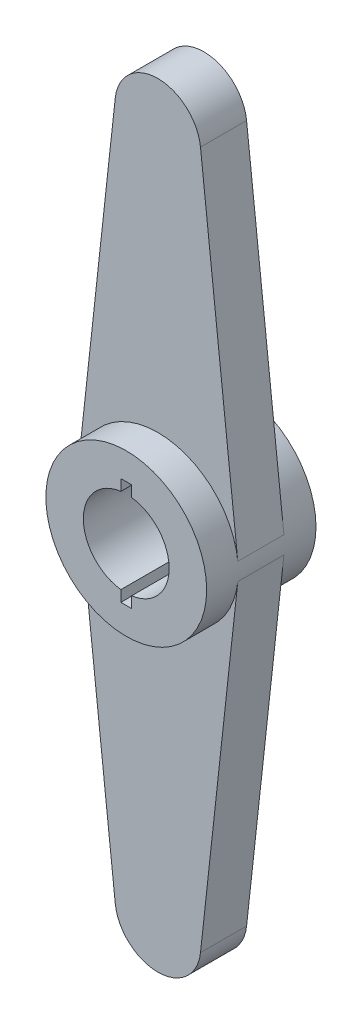
ISO-10303-21;
HEADER;
FILE_DESCRIPTION(('STEP AP214'),'2;1');
FILE_NAME('part.step','',(''),(''),'','','');
FILE_SCHEMA(('AUTOMOTIVE_DESIGN { 1 0 10303 214 1 1 1 1 }'));
ENDSEC;
DATA;
#1=APPLICATION_CONTEXT('core data for automotive mechanical design processes');
#2=APPLICATION_PROTOCOL_DEFINITION('international standard','automotive_design',2000,#1);
#3=PRODUCT_CONTEXT('',#1,'mechanical');
#4=PRODUCT('Part','Part','',(#3));
#5=PRODUCT_RELATED_PRODUCT_CATEGORY('part','',(#4));
#6=PRODUCT_DEFINITION_FORMATION('','',#4);
#7=PRODUCT_DEFINITION_CONTEXT('part definition',#1,'design');
#8=PRODUCT_DEFINITION('design','',#6,#7);
#9=PRODUCT_DEFINITION_SHAPE('','',#8);
#10=(LENGTH_UNIT() NAMED_UNIT(*) SI_UNIT(.MILLI.,.METRE.));
#11=(NAMED_UNIT(*) PLANE_ANGLE_UNIT() SI_UNIT($,.RADIAN.));
#12=(NAMED_UNIT(*) SI_UNIT($,.STERADIAN.) SOLID_ANGLE_UNIT());
#13=UNCERTAINTY_MEASURE_WITH_UNIT(LENGTH_MEASURE(1.E-05),#10,'distance_accuracy_value','');
#14=(GEOMETRIC_REPRESENTATION_CONTEXT(3) GLOBAL_UNCERTAINTY_ASSIGNED_CONTEXT((#13)) GLOBAL_UNIT_ASSIGNED_CONTEXT((#10,
#11,#12)) REPRESENTATION_CONTEXT('',''));
#15=CARTESIAN_POINT('',(0.,0.,0.));
#16=DIRECTION('',(0.,0.,1.));
#17=DIRECTION('',(1.,0.,0.));
#18=AXIS2_PLACEMENT_3D('',#15,#16,#17);
#19=CARTESIAN_POINT('',(0.,0.,2.55));
#20=DIRECTION('',(0.,0.,-1.));
#21=DIRECTION('',(-1.,0.,0.));
#22=AXIS2_PLACEMENT_3D('',#19,#20,#21);
#23=CYLINDRICAL_SURFACE('',#22,2.);
#24=CARTESIAN_POINT('',(0.,0.,-2.55));
#25=DIRECTION('',(0.,0.,1.));
#26=DIRECTION('',(1.,0.,0.));
#27=AXIS2_PLACEMENT_3D('',#24,#25,#26);
#28=CIRCLE('',#27,2.);
#29=CARTESIAN_POINT('',(-0.25,1.98431348329844,-2.55));
#30=VERTEX_POINT('',#29);
#31=CARTESIAN_POINT('',(-0.25,-1.98431348329844,-2.55));
#32=VERTEX_POINT('',#31);
#33=EDGE_CURVE('E216',#30,#32,#28,.T.);
#34=ORIENTED_EDGE('',*,*,#33,.F.);
#35=DIRECTION('',(0.,0.,-1.));
#36=VECTOR('',#35,1.);
#37=CARTESIAN_POINT('',(-0.25,1.98431348329844,2.55));
#38=LINE('',#37,#36);
#39=CARTESIAN_POINT('',(-0.25,1.98431348329844,2.55));
#40=VERTEX_POINT('',#39);
#41=EDGE_CURVE('E11',#40,#30,#38,.T.);
#42=ORIENTED_EDGE('',*,*,#41,.F.);
#43=CARTESIAN_POINT('',(0.,0.,2.55));
#44=DIRECTION('',(0.,0.,1.));
#45=DIRECTION('',(1.,0.,0.));
#46=AXIS2_PLACEMENT_3D('',#43,#44,#45);
#47=CIRCLE('',#46,2.);
#48=CARTESIAN_POINT('',(-0.25,-1.98431348329844,2.55));
#49=VERTEX_POINT('',#48);
#50=EDGE_CURVE('E217',#40,#49,#47,.T.);
#51=ORIENTED_EDGE('',*,*,#50,.T.);
#52=DIRECTION('',(0.,0.,-1.));
#53=VECTOR('',#52,1.);
#54=CARTESIAN_POINT('',(-0.25,-1.98431348329844,2.55));
#55=LINE('',#54,#53);
#56=EDGE_CURVE('E237',#49,#32,#55,.T.);
#57=ORIENTED_EDGE('',*,*,#56,.T.);
#58=EDGE_LOOP('',(#34,#42,#51,#57));
#59=FACE_BOUND('',#58,.T.);
#60=ADVANCED_FACE('F36',(#59),#23,.F.);
#61=CARTESIAN_POINT('',(-0.25,0.,2.55));
#62=DIRECTION('',(-1.,0.,0.));
#63=DIRECTION('',(0.,0.,1.));
#64=AXIS2_PLACEMENT_3D('',#61,#62,#63);
#65=PLANE('',#64);
#66=DIRECTION('',(0.,1.,0.));
#67=VECTOR('',#66,1.);
#68=CARTESIAN_POINT('',(-0.25,0.,-2.55));
#69=LINE('',#68,#67);
#70=CARTESIAN_POINT('',(-0.25,2.5,-2.55));
#71=VERTEX_POINT('',#70);
#72=EDGE_CURVE('E240',#30,#71,#69,.T.);
#73=ORIENTED_EDGE('',*,*,#72,.T.);
#74=DIRECTION('',(0.,0.,-1.));
#75=VECTOR('',#74,1.);
#76=CARTESIAN_POINT('',(-0.25,2.5,2.55));
#77=LINE('',#76,#75);
#78=CARTESIAN_POINT('',(-0.25,2.5,2.55));
#79=VERTEX_POINT('',#78);
#80=EDGE_CURVE('E44',#79,#71,#77,.T.);
#81=ORIENTED_EDGE('',*,*,#80,.F.);
#82=DIRECTION('',(0.,1.,0.));
#83=VECTOR('',#82,1.);
#84=CARTESIAN_POINT('',(-0.25,0.,2.55));
#85=LINE('',#84,#83);
#86=EDGE_CURVE('E220',#40,#79,#85,.T.);
#87=ORIENTED_EDGE('',*,*,#86,.F.);
#88=ORIENTED_EDGE('',*,*,#41,.T.);
#89=EDGE_LOOP('',(#73,#81,#87,#88));
#90=FACE_BOUND('',#89,.T.);
#91=ADVANCED_FACE('F274',(#90),#65,.F.);
#92=CARTESIAN_POINT('',(0.,2.5,2.55));
#93=DIRECTION('',(0.,-1.,0.));
#94=DIRECTION('',(0.,0.,-1.));
#95=AXIS2_PLACEMENT_3D('',#92,#93,#94);
#96=PLANE('',#95);
#97=DIRECTION('',(-1.,0.,0.));
#98=VECTOR('',#97,1.);
#99=CARTESIAN_POINT('',(0.,2.5,-2.55));
#100=LINE('',#99,#98);
#101=CARTESIAN_POINT('',(0.25,2.5,-2.55));
#102=VERTEX_POINT('',#101);
#103=EDGE_CURVE('E244',#102,#71,#100,.T.);
#104=ORIENTED_EDGE('',*,*,#103,.F.);
#105=DIRECTION('',(0.,0.,-1.));
#106=VECTOR('',#105,1.);
#107=CARTESIAN_POINT('',(0.25,2.5,2.55));
#108=LINE('',#107,#106);
#109=CARTESIAN_POINT('',(0.25,2.5,2.55));
#110=VERTEX_POINT('',#109);
#111=EDGE_CURVE('E266',#110,#102,#108,.T.);
#112=ORIENTED_EDGE('',*,*,#111,.F.);
#113=DIRECTION('',(-1.,0.,0.));
#114=VECTOR('',#113,1.);
#115=CARTESIAN_POINT('',(0.,2.5,2.55));
#116=LINE('',#115,#114);
#117=EDGE_CURVE('E224',#110,#79,#116,.T.);
#118=ORIENTED_EDGE('',*,*,#117,.T.);
#119=ORIENTED_EDGE('',*,*,#80,.T.);
#120=EDGE_LOOP('',(#104,#112,#118,#119));
#121=FACE_BOUND('',#120,.T.);
#122=ADVANCED_FACE('F38',(#121),#96,.T.);
#123=CARTESIAN_POINT('',(0.25,0.,2.55));
#124=DIRECTION('',(-1.,0.,0.));
#125=DIRECTION('',(0.,0.,1.));
#126=AXIS2_PLACEMENT_3D('',#123,#124,#125);
#127=PLANE('',#126);
#128=DIRECTION('',(0.,1.,0.));
#129=VECTOR('',#128,1.);
#130=CARTESIAN_POINT('',(0.25,0.,-2.55));
#131=LINE('',#130,#129);
#132=CARTESIAN_POINT('',(0.25,1.98431348329844,-2.55));
#133=VERTEX_POINT('',#132);
#134=EDGE_CURVE('E248',#133,#102,#131,.T.);
#135=ORIENTED_EDGE('',*,*,#134,.F.);
#136=DIRECTION('',(0.,0.,-1.));
#137=VECTOR('',#136,1.);
#138=CARTESIAN_POINT('',(0.25,1.98431348329844,2.55));
#139=LINE('',#138,#137);
#140=CARTESIAN_POINT('',(0.25,1.98431348329844,2.55));
#141=VERTEX_POINT('',#140);
#142=EDGE_CURVE('E264',#141,#133,#139,.T.);
#143=ORIENTED_EDGE('',*,*,#142,.F.);
#144=DIRECTION('',(0.,1.,0.));
#145=VECTOR('',#144,1.);
#146=CARTESIAN_POINT('',(0.25,0.,2.55));
#147=LINE('',#146,#145);
#148=EDGE_CURVE('E228',#141,#110,#147,.T.);
#149=ORIENTED_EDGE('',*,*,#148,.T.);
#150=ORIENTED_EDGE('',*,*,#111,.T.);
#151=EDGE_LOOP('',(#135,#143,#149,#150));
#152=FACE_BOUND('',#151,.T.);
#153=ADVANCED_FACE('F284',(#152),#127,.T.);
#154=CARTESIAN_POINT('',(0.25,-1.98431348329844,-2.55));
#155=VERTEX_POINT('',#154);
#156=EDGE_CURVE('E241',#155,#133,#28,.T.);
#157=ORIENTED_EDGE('',*,*,#156,.F.);
#158=DIRECTION('',(0.,0.,-1.));
#159=VECTOR('',#158,1.);
#160=CARTESIAN_POINT('',(0.25,-1.98431348329844,2.55));
#161=LINE('',#160,#159);
#162=CARTESIAN_POINT('',(0.25,-1.98431348329844,2.55));
#163=VERTEX_POINT('',#162);
#164=EDGE_CURVE('E262',#163,#155,#161,.T.);
#165=ORIENTED_EDGE('',*,*,#164,.F.);
#166=EDGE_CURVE('E222',#163,#141,#47,.T.);
#167=ORIENTED_EDGE('',*,*,#166,.T.);
#168=ORIENTED_EDGE('',*,*,#142,.T.);
#169=EDGE_LOOP('',(#157,#165,#167,#168));
#170=FACE_BOUND('',#169,.T.);
#171=ADVANCED_FACE('F310',(#170),#23,.F.);
#172=CARTESIAN_POINT('',(0.25,-2.5,-2.55));
#173=VERTEX_POINT('',#172);
#174=EDGE_CURVE('E251',#173,#155,#131,.T.);
#175=ORIENTED_EDGE('',*,*,#174,.F.);
#176=DIRECTION('',(0.,0.,-1.));
#177=VECTOR('',#176,1.);
#178=CARTESIAN_POINT('',(0.25,-2.5,2.55));
#179=LINE('',#178,#177);
#180=CARTESIAN_POINT('',(0.25,-2.5,2.55));
#181=VERTEX_POINT('',#180);
#182=EDGE_CURVE('E260',#181,#173,#179,.T.);
#183=ORIENTED_EDGE('',*,*,#182,.F.);
#184=EDGE_CURVE('E231',#181,#163,#147,.T.);
#185=ORIENTED_EDGE('',*,*,#184,.T.);
#186=ORIENTED_EDGE('',*,*,#164,.T.);
#187=EDGE_LOOP('',(#175,#183,#185,#186));
#188=FACE_BOUND('',#187,.T.);
#189=ADVANCED_FACE('F308',(#188),#127,.T.);
#190=CARTESIAN_POINT('',(0.,-2.5,2.55));
#191=DIRECTION('',(0.,-1.,0.));
#192=DIRECTION('',(0.,0.,-1.));
#193=AXIS2_PLACEMENT_3D('',#190,#191,#192);
#194=PLANE('',#193);
#195=DIRECTION('',(-1.,0.,0.));
#196=VECTOR('',#195,1.);
#197=CARTESIAN_POINT('',(0.,-2.5,-2.55));
#198=LINE('',#197,#196);
#199=CARTESIAN_POINT('',(-0.25,-2.5,-2.55));
#200=VERTEX_POINT('',#199);
#201=EDGE_CURVE('E252',#173,#200,#198,.T.);
#202=ORIENTED_EDGE('',*,*,#201,.T.);
#203=DIRECTION('',(0.,0.,-1.));
#204=VECTOR('',#203,1.);
#205=CARTESIAN_POINT('',(-0.25,-2.5,2.55));
#206=LINE('',#205,#204);
#207=CARTESIAN_POINT('',(-0.25,-2.5,2.55));
#208=VERTEX_POINT('',#207);
#209=EDGE_CURVE('E257',#208,#200,#206,.T.);
#210=ORIENTED_EDGE('',*,*,#209,.F.);
#211=DIRECTION('',(-1.,0.,0.));
#212=VECTOR('',#211,1.);
#213=CARTESIAN_POINT('',(0.,-2.5,2.55));
#214=LINE('',#213,#212);
#215=EDGE_CURVE('E232',#181,#208,#214,.T.);
#216=ORIENTED_EDGE('',*,*,#215,.F.);
#217=ORIENTED_EDGE('',*,*,#182,.T.);
#218=EDGE_LOOP('',(#202,#210,#216,#217));
#219=FACE_BOUND('',#218,.T.);
#220=ADVANCED_FACE('F304',(#219),#194,.F.);
#221=EDGE_CURVE('E245',#200,#32,#69,.T.);
#222=ORIENTED_EDGE('',*,*,#221,.T.);
#223=ORIENTED_EDGE('',*,*,#56,.F.);
#224=EDGE_CURVE('E225',#208,#49,#85,.T.);
#225=ORIENTED_EDGE('',*,*,#224,.F.);
#226=ORIENTED_EDGE('',*,*,#209,.T.);
#227=EDGE_LOOP('',(#222,#223,#225,#226));
#228=FACE_BOUND('',#227,.T.);
#229=ADVANCED_FACE('F300',(#228),#65,.F.);
#230=CARTESIAN_POINT('',(0.,0.,2.55));
#231=DIRECTION('',(0.,0.,-1.));
#232=DIRECTION('',(-1.,0.,0.));
#233=AXIS2_PLACEMENT_3D('',#230,#231,#232);
#234=CYLINDRICAL_SURFACE('',#233,3.75);
#235=DIRECTION('',(0.,0.,-1.));
#236=VECTOR('',#235,1.);
#237=CARTESIAN_POINT('',(-3.72764246788992,-0.408878504672898,1.075));
#238=LINE('',#237,#236);
#239=CARTESIAN_POINT('',(-3.72764246788992,-0.408878504672898,1.075));
#240=VERTEX_POINT('',#239);
#241=CARTESIAN_POINT('',(-3.72764246788992,-0.408878504672898,-1.075));
#242=VERTEX_POINT('',#241);
#243=EDGE_CURVE('E51',#240,#242,#238,.T.);
#244=ORIENTED_EDGE('',*,*,#243,.F.);
#245=CARTESIAN_POINT('',(0.,0.,1.075));
#246=DIRECTION('',(0.,0.,1.));
#247=DIRECTION('',(1.,0.,0.));
#248=AXIS2_PLACEMENT_3D('',#245,#246,#247);
#249=CIRCLE('',#248,3.75);
#250=CARTESIAN_POINT('',(3.72764246788992,-0.408878504672896,1.075));
#251=VERTEX_POINT('',#250);
#252=EDGE_CURVE('E56',#240,#251,#249,.T.);
#253=ORIENTED_EDGE('',*,*,#252,.T.);
#254=DIRECTION('',(0.,0.,-1.));
#255=VECTOR('',#254,1.);
#256=CARTESIAN_POINT('',(3.72764246788992,-0.408878504672896,1.075));
#257=LINE('',#256,#255);
#258=CARTESIAN_POINT('',(3.72764246788992,-0.408878504672896,-1.075));
#259=VERTEX_POINT('',#258);
#260=EDGE_CURVE('E168',#251,#259,#257,.T.);
#261=ORIENTED_EDGE('',*,*,#260,.T.);
#262=CARTESIAN_POINT('',(0.,0.,-1.075));
#263=DIRECTION('',(0.,0.,1.));
#264=DIRECTION('',(1.,0.,0.));
#265=AXIS2_PLACEMENT_3D('',#262,#263,#264);
#266=CIRCLE('',#265,3.75);
#267=EDGE_CURVE('E172',#242,#259,#266,.T.);
#268=ORIENTED_EDGE('',*,*,#267,.F.);
#269=EDGE_LOOP('',(#244,#253,#261,#268));
#270=FACE_BOUND('',#269,.T.);
#271=DIRECTION('',(0.,0.,-1.));
#272=VECTOR('',#271,1.);
#273=CARTESIAN_POINT('',(3.72764246788992,0.408878504672897,1.075));
#274=LINE('',#273,#272);
#275=CARTESIAN_POINT('',(3.72764246788992,0.408878504672897,1.075));
#276=VERTEX_POINT('',#275);
#277=CARTESIAN_POINT('',(3.72764246788992,0.408878504672897,-1.075));
#278=VERTEX_POINT('',#277);
#279=EDGE_CURVE('E196',#276,#278,#274,.T.);
#280=ORIENTED_EDGE('',*,*,#279,.F.);
#281=CARTESIAN_POINT('',(0.,0.,1.075));
#282=DIRECTION('',(0.,0.,1.));
#283=DIRECTION('',(1.,0.,0.));
#284=AXIS2_PLACEMENT_3D('',#281,#282,#283);
#285=CIRCLE('',#284,3.75);
#286=CARTESIAN_POINT('',(-3.72764246788992,0.408878504672897,1.075));
#287=VERTEX_POINT('',#286);
#288=EDGE_CURVE('E194',#276,#287,#285,.T.);
#289=ORIENTED_EDGE('',*,*,#288,.T.);
#290=DIRECTION('',(0.,0.,-1.));
#291=VECTOR('',#290,1.);
#292=CARTESIAN_POINT('',(-3.72764246788992,0.408878504672897,1.075));
#293=LINE('',#292,#291);
#294=CARTESIAN_POINT('',(-3.72764246788992,0.408878504672897,-1.075));
#295=VERTEX_POINT('',#294);
#296=EDGE_CURVE('E209',#287,#295,#293,.T.);
#297=ORIENTED_EDGE('',*,*,#296,.T.);
#298=CARTESIAN_POINT('',(0.,0.,-1.075));
#299=DIRECTION('',(0.,0.,1.));
#300=DIRECTION('',(1.,0.,0.));
#301=AXIS2_PLACEMENT_3D('',#298,#299,#300);
#302=CIRCLE('',#301,3.75);
#303=EDGE_CURVE('E189',#278,#295,#302,.T.);
#304=ORIENTED_EDGE('',*,*,#303,.F.);
#305=EDGE_LOOP('',(#280,#289,#297,#304));
#306=FACE_BOUND('',#305,.T.);
#307=CARTESIAN_POINT('',(0.,0.,2.55));
#308=DIRECTION('',(0.,0.,1.));
#309=DIRECTION('',(1.,0.,0.));
#310=AXIS2_PLACEMENT_3D('',#307,#308,#309);
#311=CIRCLE('',#310,3.75);
#312=CARTESIAN_POINT('',(3.75,0.,2.55));
#313=VERTEX_POINT('',#312);
#314=EDGE_CURVE('E234',#313,#313,#311,.T.);
#315=ORIENTED_EDGE('',*,*,#314,.F.);
#316=EDGE_LOOP('',(#315));
#317=FACE_BOUND('',#316,.T.);
#318=CARTESIAN_POINT('',(0.,0.,-2.55));
#319=DIRECTION('',(0.,0.,1.));
#320=DIRECTION('',(1.,0.,0.));
#321=AXIS2_PLACEMENT_3D('',#318,#319,#320);
#322=CIRCLE('',#321,3.75);
#323=CARTESIAN_POINT('',(3.75,0.,-2.55));
#324=VERTEX_POINT('',#323);
#325=EDGE_CURVE('E221',#324,#324,#322,.T.);
#326=ORIENTED_EDGE('',*,*,#325,.T.);
#327=EDGE_LOOP('',(#326));
#328=FACE_BOUND('',#327,.T.);
#329=ADVANCED_FACE('F328',(#270,#306,#317,#328),#234,.T.);
#330=CARTESIAN_POINT('',(0.,0.,2.55));
#331=DIRECTION('',(0.,0.,1.));
#332=DIRECTION('',(1.,0.,0.));
#333=AXIS2_PLACEMENT_3D('',#330,#331,#332);
#334=PLANE('',#333);
#335=ORIENTED_EDGE('',*,*,#50,.F.);
#336=ORIENTED_EDGE('',*,*,#86,.T.);
#337=ORIENTED_EDGE('',*,*,#117,.F.);
#338=ORIENTED_EDGE('',*,*,#148,.F.);
#339=ORIENTED_EDGE('',*,*,#166,.F.);
#340=ORIENTED_EDGE('',*,*,#184,.F.);
#341=ORIENTED_EDGE('',*,*,#215,.T.);
#342=ORIENTED_EDGE('',*,*,#224,.T.);
#343=EDGE_LOOP('',(#335,#336,#337,#338,#339,#340,#341,#342));
#344=FACE_BOUND('',#343,.T.);
#345=ORIENTED_EDGE('',*,*,#314,.T.);
#346=EDGE_LOOP('',(#345));
#347=FACE_BOUND('',#346,.T.);
#348=ADVANCED_FACE('F288',(#344,#347),#334,.T.);
#349=CARTESIAN_POINT('',(0.,0.,-2.55));
#350=DIRECTION('',(0.,0.,1.));
#351=DIRECTION('',(1.,0.,0.));
#352=AXIS2_PLACEMENT_3D('',#349,#350,#351);
#353=PLANE('',#352);
#354=ORIENTED_EDGE('',*,*,#33,.T.);
#355=ORIENTED_EDGE('',*,*,#221,.F.);
#356=ORIENTED_EDGE('',*,*,#201,.F.);
#357=ORIENTED_EDGE('',*,*,#174,.T.);
#358=ORIENTED_EDGE('',*,*,#156,.T.);
#359=ORIENTED_EDGE('',*,*,#134,.T.);
#360=ORIENTED_EDGE('',*,*,#103,.T.);
#361=ORIENTED_EDGE('',*,*,#72,.F.);
#362=EDGE_LOOP('',(#354,#355,#356,#357,#358,#359,#360,#361));
#363=FACE_BOUND('',#362,.T.);
#364=ORIENTED_EDGE('',*,*,#325,.F.);
#365=EDGE_LOOP('',(#364));
#366=FACE_BOUND('',#365,.T.);
#367=ADVANCED_FACE('F277',(#363,#366),#353,.F.);
#368=CARTESIAN_POINT('',(3.72764246788992,0.408878504672897,1.075));
#369=DIRECTION('',(-0.994037991437312,-0.109034267912773,0.));
#370=DIRECTION('',(0.109034267912773,-0.994037991437312,0.));
#371=AXIS2_PLACEMENT_3D('',#368,#369,#370);
#372=PLANE('',#371);
#373=DIRECTION('',(-0.109034267912773,0.994037991437312,0.));
#374=VECTOR('',#373,1.);
#375=CARTESIAN_POINT('',(3.72764246788992,0.408878504672897,-1.075));
#376=LINE('',#375,#374);
#377=CARTESIAN_POINT('',(1.98807598287462,16.2680685358255,-1.075));
#378=VERTEX_POINT('',#377);
#379=EDGE_CURVE('E184',#278,#378,#376,.T.);
#380=ORIENTED_EDGE('',*,*,#379,.T.);
#381=DIRECTION('',(0.,0.,-1.));
#382=VECTOR('',#381,1.);
#383=CARTESIAN_POINT('',(1.98807598287462,16.2680685358255,1.075));
#384=LINE('',#383,#382);
#385=CARTESIAN_POINT('',(1.98807598287462,16.2680685358255,1.075));
#386=VERTEX_POINT('',#385);
#387=EDGE_CURVE('E213',#386,#378,#384,.T.);
#388=ORIENTED_EDGE('',*,*,#387,.F.);
#389=DIRECTION('',(-0.109034267912773,0.994037991437312,0.));
#390=VECTOR('',#389,1.);
#391=CARTESIAN_POINT('',(3.72764246788992,0.408878504672897,1.075));
#392=LINE('',#391,#390);
#393=EDGE_CURVE('E185',#276,#386,#392,.T.);
#394=ORIENTED_EDGE('',*,*,#393,.F.);
#395=ORIENTED_EDGE('',*,*,#279,.T.);
#396=EDGE_LOOP('',(#380,#388,#394,#395));
#397=FACE_BOUND('',#396,.T.);
#398=ADVANCED_FACE('F392',(#397),#372,.F.);
#399=CARTESIAN_POINT('',(0.,16.05,1.075));
#400=DIRECTION('',(0.,0.,-1.));
#401=DIRECTION('',(-1.,0.,0.));
#402=AXIS2_PLACEMENT_3D('',#399,#400,#401);
#403=CYLINDRICAL_SURFACE('',#402,2.);
#404=CARTESIAN_POINT('',(0.,16.05,-1.075));
#405=DIRECTION('',(0.,0.,1.));
#406=DIRECTION('',(1.,0.,0.));
#407=AXIS2_PLACEMENT_3D('',#404,#405,#406);
#408=CIRCLE('',#407,2.);
#409=CARTESIAN_POINT('',(-1.98807598287462,16.2680685358255,-1.075));
#410=VERTEX_POINT('',#409);
#411=EDGE_CURVE('E199',#378,#410,#408,.T.);
#412=ORIENTED_EDGE('',*,*,#411,.T.);
#413=DIRECTION('',(0.,0.,-1.));
#414=VECTOR('',#413,1.);
#415=CARTESIAN_POINT('',(-1.98807598287462,16.2680685358255,1.075));
#416=LINE('',#415,#414);
#417=CARTESIAN_POINT('',(-1.98807598287462,16.2680685358255,1.075));
#418=VERTEX_POINT('',#417);
#419=EDGE_CURVE('E211',#418,#410,#416,.T.);
#420=ORIENTED_EDGE('',*,*,#419,.F.);
#421=CARTESIAN_POINT('',(0.,16.05,1.075));
#422=DIRECTION('',(0.,0.,1.));
#423=DIRECTION('',(1.,0.,0.));
#424=AXIS2_PLACEMENT_3D('',#421,#422,#423);
#425=CIRCLE('',#424,2.);
#426=EDGE_CURVE('E188',#386,#418,#425,.T.);
#427=ORIENTED_EDGE('',*,*,#426,.F.);
#428=ORIENTED_EDGE('',*,*,#387,.T.);
#429=EDGE_LOOP('',(#412,#420,#427,#428));
#430=FACE_BOUND('',#429,.T.);
#431=ADVANCED_FACE('F399',(#430),#403,.T.);
#432=CARTESIAN_POINT('',(-3.72764246788992,0.408878504672897,1.075));
#433=DIRECTION('',(-0.994037991437312,0.109034267912773,0.));
#434=DIRECTION('',(-0.109034267912773,-0.994037991437312,0.));
#435=AXIS2_PLACEMENT_3D('',#432,#433,#434);
#436=PLANE('',#435);
#437=DIRECTION('',(0.109034267912773,0.994037991437312,0.));
#438=VECTOR('',#437,1.);
#439=CARTESIAN_POINT('',(-3.72764246788992,0.408878504672897,-1.075));
#440=LINE('',#439,#438);
#441=EDGE_CURVE('E202',#295,#410,#440,.T.);
#442=ORIENTED_EDGE('',*,*,#441,.F.);
#443=ORIENTED_EDGE('',*,*,#296,.F.);
#444=DIRECTION('',(0.109034267912773,0.994037991437312,0.));
#445=VECTOR('',#444,1.);
#446=CARTESIAN_POINT('',(-3.72764246788992,0.408878504672897,1.075));
#447=LINE('',#446,#445);
#448=EDGE_CURVE('E191',#287,#418,#447,.T.);
#449=ORIENTED_EDGE('',*,*,#448,.T.);
#450=ORIENTED_EDGE('',*,*,#419,.T.);
#451=EDGE_LOOP('',(#442,#443,#449,#450));
#452=FACE_BOUND('',#451,.T.);
#453=ADVANCED_FACE('F408',(#452),#436,.T.);
#454=CARTESIAN_POINT('',(0.,0.,1.075));
#455=DIRECTION('',(0.,0.,1.));
#456=DIRECTION('',(1.,0.,0.));
#457=AXIS2_PLACEMENT_3D('',#454,#455,#456);
#458=PLANE('',#457);
#459=ORIENTED_EDGE('',*,*,#393,.T.);
#460=ORIENTED_EDGE('',*,*,#426,.T.);
#461=ORIENTED_EDGE('',*,*,#448,.F.);
#462=ORIENTED_EDGE('',*,*,#288,.F.);
#463=EDGE_LOOP('',(#459,#460,#461,#462));
#464=FACE_BOUND('',#463,.T.);
#465=ADVANCED_FACE('F417',(#464),#458,.T.);
#466=CARTESIAN_POINT('',(0.,0.,-1.075));
#467=DIRECTION('',(0.,0.,1.));
#468=DIRECTION('',(1.,0.,0.));
#469=AXIS2_PLACEMENT_3D('',#466,#467,#468);
#470=PLANE('',#469);
#471=ORIENTED_EDGE('',*,*,#379,.F.);
#472=ORIENTED_EDGE('',*,*,#303,.T.);
#473=ORIENTED_EDGE('',*,*,#441,.T.);
#474=ORIENTED_EDGE('',*,*,#411,.F.);
#475=EDGE_LOOP('',(#471,#472,#473,#474));
#476=FACE_BOUND('',#475,.T.);
#477=ADVANCED_FACE('F426',(#476),#470,.F.);
#478=CARTESIAN_POINT('',(-3.72764246788992,-0.408878504672898,1.075));
#479=DIRECTION('',(0.994037991437312,0.109034267912773,0.));
#480=DIRECTION('',(-0.109034267912773,0.994037991437312,0.));
#481=AXIS2_PLACEMENT_3D('',#478,#479,#480);
#482=PLANE('',#481);
#483=DIRECTION('',(0.109034267912773,-0.994037991437312,0.));
#484=VECTOR('',#483,1.);
#485=CARTESIAN_POINT('',(-3.72764246788992,-0.408878504672898,-1.075));
#486=LINE('',#485,#484);
#487=CARTESIAN_POINT('',(-1.98807598287462,-16.2680685358255,-1.075));
#488=VERTEX_POINT('',#487);
#489=EDGE_CURVE('E158',#242,#488,#486,.T.);
#490=ORIENTED_EDGE('',*,*,#489,.T.);
#491=DIRECTION('',(0.,0.,-1.));
#492=VECTOR('',#491,1.);
#493=CARTESIAN_POINT('',(-1.98807598287462,-16.2680685358255,1.075));
#494=LINE('',#493,#492);
#495=CARTESIAN_POINT('',(-1.98807598287462,-16.2680685358255,1.075));
#496=VERTEX_POINT('',#495);
#497=EDGE_CURVE('E155',#496,#488,#494,.T.);
#498=ORIENTED_EDGE('',*,*,#497,.F.);
#499=DIRECTION('',(0.109034267912773,-0.994037991437312,0.));
#500=VECTOR('',#499,1.);
#501=CARTESIAN_POINT('',(-3.72764246788992,-0.408878504672898,1.075));
#502=LINE('',#501,#500);
#503=EDGE_CURVE('E145',#240,#496,#502,.T.);
#504=ORIENTED_EDGE('',*,*,#503,.F.);
#505=ORIENTED_EDGE('',*,*,#243,.T.);
#506=EDGE_LOOP('',(#490,#498,#504,#505));
#507=FACE_BOUND('',#506,.T.);
#508=ADVANCED_FACE('F156',(#507),#482,.F.);
#509=CARTESIAN_POINT('',(0.,-16.05,1.075));
#510=DIRECTION('',(0.,0.,-1.));
#511=DIRECTION('',(-1.,0.,0.));
#512=AXIS2_PLACEMENT_3D('',#509,#510,#511);
#513=CYLINDRICAL_SURFACE('',#512,2.);
#514=CARTESIAN_POINT('',(0.,-16.05,-1.075));
#515=DIRECTION('',(0.,0.,1.));
#516=DIRECTION('',(1.,0.,0.));
#517=AXIS2_PLACEMENT_3D('',#514,#515,#516);
#518=CIRCLE('',#517,2.);
#519=CARTESIAN_POINT('',(1.98807598287463,-16.2680685358255,-1.075));
#520=VERTEX_POINT('',#519);
#521=EDGE_CURVE('E176',#488,#520,#518,.T.);
#522=ORIENTED_EDGE('',*,*,#521,.T.);
#523=DIRECTION('',(0.,0.,-1.));
#524=VECTOR('',#523,1.);
#525=CARTESIAN_POINT('',(1.98807598287463,-16.2680685358255,1.075));
#526=LINE('',#525,#524);
#527=CARTESIAN_POINT('',(1.98807598287463,-16.2680685358255,1.075));
#528=VERTEX_POINT('',#527);
#529=EDGE_CURVE('E162',#528,#520,#526,.T.);
#530=ORIENTED_EDGE('',*,*,#529,.F.);
#531=CARTESIAN_POINT('',(0.,-16.05,1.075));
#532=DIRECTION('',(0.,0.,1.));
#533=DIRECTION('',(1.,0.,0.));
#534=AXIS2_PLACEMENT_3D('',#531,#532,#533);
#535=CIRCLE('',#534,2.);
#536=EDGE_CURVE('E150',#496,#528,#535,.T.);
#537=ORIENTED_EDGE('',*,*,#536,.F.);
#538=ORIENTED_EDGE('',*,*,#497,.T.);
#539=EDGE_LOOP('',(#522,#530,#537,#538));
#540=FACE_BOUND('',#539,.T.);
#541=ADVANCED_FACE('F164',(#540),#513,.T.);
#542=CARTESIAN_POINT('',(3.72764246788992,-0.408878504672896,1.075));
#543=DIRECTION('',(0.994037991437312,-0.109034267912772,0.));
#544=DIRECTION('',(0.109034267912772,0.994037991437312,0.));
#545=AXIS2_PLACEMENT_3D('',#542,#543,#544);
#546=PLANE('',#545);
#547=DIRECTION('',(-0.109034267912772,-0.994037991437312,0.));
#548=VECTOR('',#547,1.);
#549=CARTESIAN_POINT('',(3.72764246788992,-0.408878504672896,-1.075));
#550=LINE('',#549,#548);
#551=EDGE_CURVE('E178',#259,#520,#550,.T.);
#552=ORIENTED_EDGE('',*,*,#551,.F.);
#553=ORIENTED_EDGE('',*,*,#260,.F.);
#554=DIRECTION('',(-0.109034267912772,-0.994037991437312,0.));
#555=VECTOR('',#554,1.);
#556=CARTESIAN_POINT('',(3.72764246788992,-0.408878504672896,1.075));
#557=LINE('',#556,#555);
#558=EDGE_CURVE('E166',#251,#528,#557,.T.);
#559=ORIENTED_EDGE('',*,*,#558,.T.);
#560=ORIENTED_EDGE('',*,*,#529,.T.);
#561=EDGE_LOOP('',(#552,#553,#559,#560));
#562=FACE_BOUND('',#561,.T.);
#563=ADVANCED_FACE('F450',(#562),#546,.T.);
#564=CARTESIAN_POINT('',(0.,0.,1.075));
#565=DIRECTION('',(0.,0.,1.));
#566=DIRECTION('',(1.,0.,0.));
#567=AXIS2_PLACEMENT_3D('',#564,#565,#566);
#568=PLANE('',#567);
#569=ORIENTED_EDGE('',*,*,#252,.F.);
#570=ORIENTED_EDGE('',*,*,#503,.T.);
#571=ORIENTED_EDGE('',*,*,#536,.T.);
#572=ORIENTED_EDGE('',*,*,#558,.F.);
#573=EDGE_LOOP('',(#569,#570,#571,#572));
#574=FACE_BOUND('',#573,.T.);
#575=ADVANCED_FACE('F147',(#574),#568,.T.);
#576=CARTESIAN_POINT('',(0.,0.,-1.075));
#577=DIRECTION('',(0.,0.,1.));
#578=DIRECTION('',(1.,0.,0.));
#579=AXIS2_PLACEMENT_3D('',#576,#577,#578);
#580=PLANE('',#579);
#581=ORIENTED_EDGE('',*,*,#267,.T.);
#582=ORIENTED_EDGE('',*,*,#551,.T.);
#583=ORIENTED_EDGE('',*,*,#521,.F.);
#584=ORIENTED_EDGE('',*,*,#489,.F.);
#585=EDGE_LOOP('',(#581,#582,#583,#584));
#586=FACE_BOUND('',#585,.T.);
#587=ADVANCED_FACE('F466',(#586),#580,.F.);
#588=CLOSED_SHELL('',(#60,#91,#122,#153,#171,#189,#220,#229,#329,#348,#367,#398,#431,#453,#465,
#477,#508,#541,#563,#575,#587));
#589=MANIFOLD_SOLID_BREP('B2',#588);
#590=ADVANCED_BREP_SHAPE_REPRESENTATION('',(#18,#589),#14);
#591=SHAPE_DEFINITION_REPRESENTATION(#9,#590);
ENDSEC;
END-ISO-10303-21;
